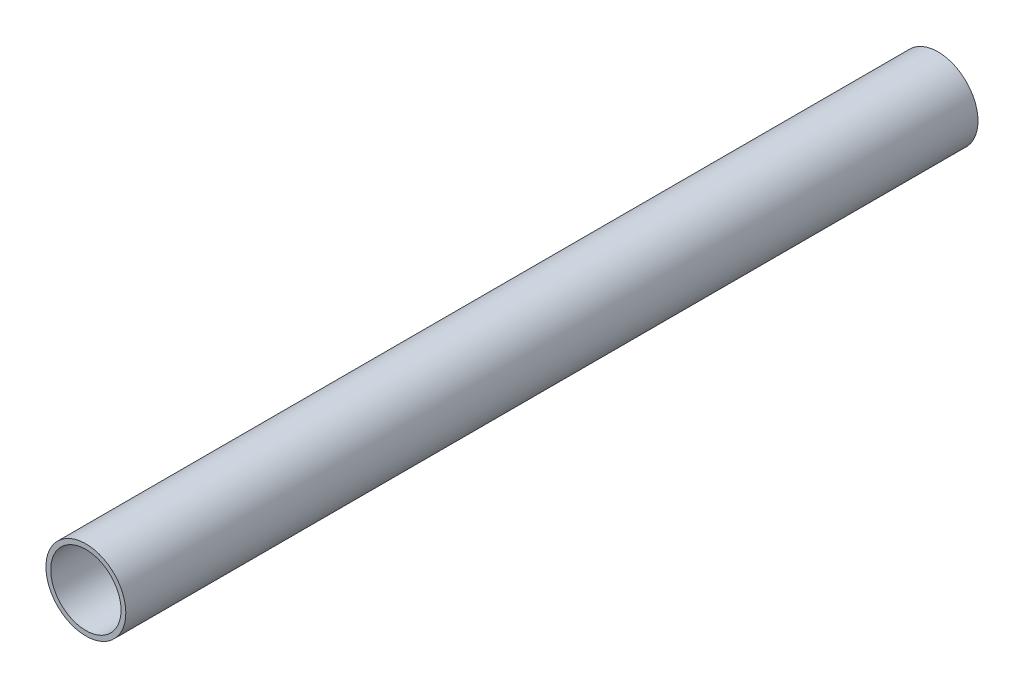
ISO-10303-21;
HEADER;
FILE_DESCRIPTION(('STEP AP214'),'2;1');
FILE_NAME('part.step','',(''),(''),'','','');
FILE_SCHEMA(('AUTOMOTIVE_DESIGN { 1 0 10303 214 1 1 1 1 }'));
ENDSEC;
DATA;
#1=APPLICATION_CONTEXT('core data for automotive mechanical design processes');
#2=APPLICATION_PROTOCOL_DEFINITION('international standard','automotive_design',2000,#1);
#3=PRODUCT_CONTEXT('',#1,'mechanical');
#4=PRODUCT('Part','Part','',(#3));
#5=PRODUCT_RELATED_PRODUCT_CATEGORY('part','',(#4));
#6=PRODUCT_DEFINITION_FORMATION('','',#4);
#7=PRODUCT_DEFINITION_CONTEXT('part definition',#1,'design');
#8=PRODUCT_DEFINITION('design','',#6,#7);
#9=PRODUCT_DEFINITION_SHAPE('','',#8);
#10=(LENGTH_UNIT() NAMED_UNIT(*) SI_UNIT(.MILLI.,.METRE.));
#11=(NAMED_UNIT(*) PLANE_ANGLE_UNIT() SI_UNIT($,.RADIAN.));
#12=(NAMED_UNIT(*) SI_UNIT($,.STERADIAN.) SOLID_ANGLE_UNIT());
#13=UNCERTAINTY_MEASURE_WITH_UNIT(LENGTH_MEASURE(1.E-05),#10,'distance_accuracy_value','');
#14=(GEOMETRIC_REPRESENTATION_CONTEXT(3) GLOBAL_UNCERTAINTY_ASSIGNED_CONTEXT((#13)) GLOBAL_UNIT_ASSIGNED_CONTEXT((#10,
#11,#12)) REPRESENTATION_CONTEXT('',''));
#15=CARTESIAN_POINT('',(0.,0.,0.));
#16=DIRECTION('',(0.,0.,1.));
#17=DIRECTION('',(1.,0.,0.));
#18=AXIS2_PLACEMENT_3D('',#15,#16,#17);
#19=CARTESIAN_POINT('',(0.,0.,203.2));
#20=DIRECTION('',(0.,0.,1.));
#21=DIRECTION('',(1.,0.,0.));
#22=AXIS2_PLACEMENT_3D('',#19,#20,#21);
#23=PLANE('',#22);
#24=CARTESIAN_POINT('',(0.,0.,203.2));
#25=DIRECTION('',(0.,0.,1.));
#26=DIRECTION('',(1.,0.,0.));
#27=AXIS2_PLACEMENT_3D('',#24,#25,#26);
#28=CIRCLE('',#27,9.525);
#29=CARTESIAN_POINT('',(9.525,0.,203.2));
#30=VERTEX_POINT('',#29);
#31=EDGE_CURVE('E10',#30,#30,#28,.T.);
#32=ORIENTED_EDGE('',*,*,#31,.T.);
#33=EDGE_LOOP('',(#32));
#34=FACE_BOUND('',#33,.T.);
#35=CARTESIAN_POINT('',(0.,0.,203.2));
#36=DIRECTION('',(0.,0.,1.));
#37=DIRECTION('',(1.,0.,0.));
#38=AXIS2_PLACEMENT_3D('',#35,#36,#37);
#39=CIRCLE('',#38,8.382);
#40=CARTESIAN_POINT('',(8.382,0.,203.2));
#41=VERTEX_POINT('',#40);
#42=EDGE_CURVE('E45',#41,#41,#39,.T.);
#43=ORIENTED_EDGE('',*,*,#42,.F.);
#44=EDGE_LOOP('',(#43));
#45=FACE_BOUND('',#44,.T.);
#46=ADVANCED_FACE('F34',(#34,#45),#23,.T.);
#47=CARTESIAN_POINT('',(0.,0.,0.));
#48=DIRECTION('',(0.,0.,1.));
#49=DIRECTION('',(1.,0.,0.));
#50=AXIS2_PLACEMENT_3D('',#47,#48,#49);
#51=PLANE('',#50);
#52=CARTESIAN_POINT('',(0.,0.,0.));
#53=DIRECTION('',(0.,0.,1.));
#54=DIRECTION('',(1.,0.,0.));
#55=AXIS2_PLACEMENT_3D('',#52,#53,#54);
#56=CIRCLE('',#55,9.525);
#57=CARTESIAN_POINT('',(9.525,0.,0.));
#58=VERTEX_POINT('',#57);
#59=EDGE_CURVE('E38',#58,#58,#56,.T.);
#60=ORIENTED_EDGE('',*,*,#59,.F.);
#61=EDGE_LOOP('',(#60));
#62=FACE_BOUND('',#61,.T.);
#63=CARTESIAN_POINT('',(0.,0.,0.));
#64=DIRECTION('',(0.,0.,1.));
#65=DIRECTION('',(1.,0.,0.));
#66=AXIS2_PLACEMENT_3D('',#63,#64,#65);
#67=CIRCLE('',#66,8.382);
#68=CARTESIAN_POINT('',(8.382,0.,0.));
#69=VERTEX_POINT('',#68);
#70=EDGE_CURVE('E47',#69,#69,#67,.T.);
#71=ORIENTED_EDGE('',*,*,#70,.T.);
#72=EDGE_LOOP('',(#71));
#73=FACE_BOUND('',#72,.T.);
#74=ADVANCED_FACE('F57',(#62,#73),#51,.F.);
#75=CARTESIAN_POINT('',(0.,0.,203.2));
#76=DIRECTION('',(0.,0.,-1.));
#77=DIRECTION('',(-1.,0.,0.));
#78=AXIS2_PLACEMENT_3D('',#75,#76,#77);
#79=CYLINDRICAL_SURFACE('',#78,9.525);
#80=ORIENTED_EDGE('',*,*,#31,.F.);
#81=EDGE_LOOP('',(#80));
#82=FACE_BOUND('',#81,.T.);
#83=ORIENTED_EDGE('',*,*,#59,.T.);
#84=EDGE_LOOP('',(#83));
#85=FACE_BOUND('',#84,.T.);
#86=ADVANCED_FACE('F36',(#82,#85),#79,.T.);
#87=CARTESIAN_POINT('',(0.,0.,203.2));
#88=DIRECTION('',(0.,0.,-1.));
#89=DIRECTION('',(-1.,0.,0.));
#90=AXIS2_PLACEMENT_3D('',#87,#88,#89);
#91=CYLINDRICAL_SURFACE('',#90,8.382);
#92=ORIENTED_EDGE('',*,*,#42,.T.);
#93=EDGE_LOOP('',(#92));
#94=FACE_BOUND('',#93,.T.);
#95=ORIENTED_EDGE('',*,*,#70,.F.);
#96=EDGE_LOOP('',(#95));
#97=FACE_BOUND('',#96,.T.);
#98=ADVANCED_FACE('F53',(#94,#97),#91,.F.);
#99=CLOSED_SHELL('',(#46,#74,#86,#98));
#100=MANIFOLD_SOLID_BREP('B2',#99);
#101=ADVANCED_BREP_SHAPE_REPRESENTATION('',(#18,#100),#14);
#102=SHAPE_DEFINITION_REPRESENTATION(#9,#101);
ENDSEC;
END-ISO-10303-21;
